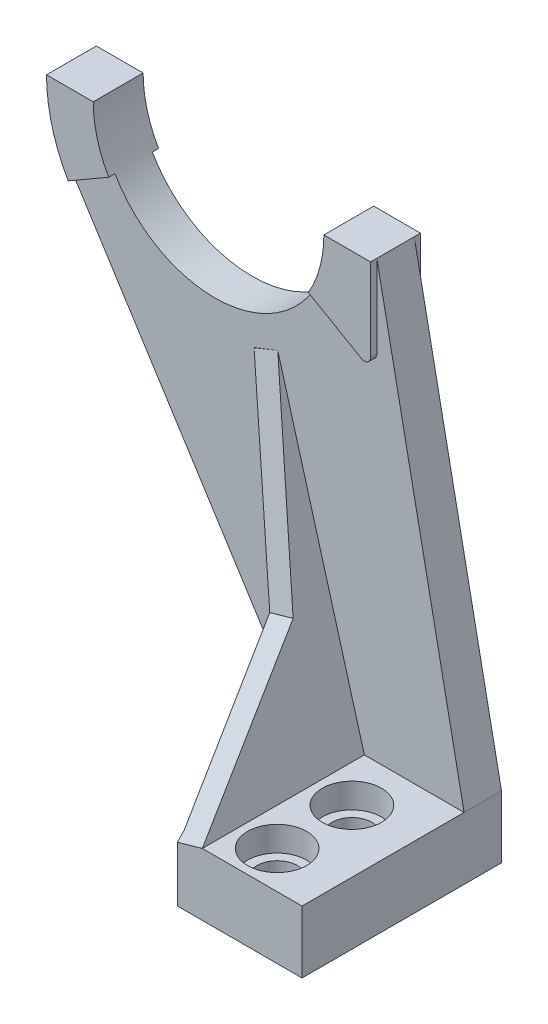
ISO-10303-21;
HEADER;
FILE_DESCRIPTION(('STEP AP214'),'2;1');
FILE_NAME('part.step','',(''),(''),'','','');
FILE_SCHEMA(('AUTOMOTIVE_DESIGN { 1 0 10303 214 1 1 1 1 }'));
ENDSEC;
DATA;
#1=APPLICATION_CONTEXT('core data for automotive mechanical design processes');
#2=APPLICATION_PROTOCOL_DEFINITION('international standard','automotive_design',2000,#1);
#3=PRODUCT_CONTEXT('',#1,'mechanical');
#4=PRODUCT('Part','Part','',(#3));
#5=PRODUCT_RELATED_PRODUCT_CATEGORY('part','',(#4));
#6=PRODUCT_DEFINITION_FORMATION('','',#4);
#7=PRODUCT_DEFINITION_CONTEXT('part definition',#1,'design');
#8=PRODUCT_DEFINITION('design','',#6,#7);
#9=PRODUCT_DEFINITION_SHAPE('','',#8);
#10=(LENGTH_UNIT() NAMED_UNIT(*) SI_UNIT(.MILLI.,.METRE.));
#11=(NAMED_UNIT(*) PLANE_ANGLE_UNIT() SI_UNIT($,.RADIAN.));
#12=(NAMED_UNIT(*) SI_UNIT($,.STERADIAN.) SOLID_ANGLE_UNIT());
#13=UNCERTAINTY_MEASURE_WITH_UNIT(LENGTH_MEASURE(1.E-05),#10,'distance_accuracy_value','');
#14=(GEOMETRIC_REPRESENTATION_CONTEXT(3) GLOBAL_UNCERTAINTY_ASSIGNED_CONTEXT((#13)) GLOBAL_UNIT_ASSIGNED_CONTEXT((#10,
#11,#12)) REPRESENTATION_CONTEXT('',''));
#15=CARTESIAN_POINT('',(0.,0.,0.));
#16=DIRECTION('',(0.,0.,1.));
#17=DIRECTION('',(1.,0.,0.));
#18=AXIS2_PLACEMENT_3D('',#15,#16,#17);
#19=CARTESIAN_POINT('',(0.,0.,9.525));
#20=DIRECTION('',(0.,0.,1.));
#21=DIRECTION('',(1.,0.,0.));
#22=AXIS2_PLACEMENT_3D('',#19,#20,#21);
#23=PLANE('',#22);
#24=DIRECTION('',(-0.931022526709216,-0.364961716841625,0.));
#25=VECTOR('',#24,1.);
#26=CARTESIAN_POINT('',(1.97344956518825,29.4120714378824,9.525));
#27=LINE('',#26,#25);
#28=CARTESIAN_POINT('',(4.92944608749001,30.5708248888546,9.525));
#29=VERTEX_POINT('',#28);
#30=CARTESIAN_POINT('',(-0.98254695711351,28.2533179869102,9.525));
#31=VERTEX_POINT('',#30);
#32=EDGE_CURVE('E224',#29,#31,#27,.T.);
#33=ORIENTED_EDGE('',*,*,#32,.F.);
#34=DIRECTION('',(-0.271492330217385,0.962440603171507,0.));
#35=VECTOR('',#34,1.);
#36=CARTESIAN_POINT('',(26.9875,-47.625,9.525));
#37=LINE('',#36,#35);
#38=CARTESIAN_POINT('',(26.9875,-47.625,9.525));
#39=VERTEX_POINT('',#38);
#40=EDGE_CURVE('E214',#39,#29,#37,.T.);
#41=ORIENTED_EDGE('',*,*,#40,.F.);
#42=DIRECTION('',(-1.,0.,0.));
#43=VECTOR('',#42,1.);
#44=CARTESIAN_POINT('',(20.6375,-47.625,9.525));
#45=LINE('',#44,#43);
#46=CARTESIAN_POINT('',(52.3875,-47.625,9.525));
#47=VERTEX_POINT('',#46);
#48=EDGE_CURVE('E327',#47,#39,#45,.T.);
#49=ORIENTED_EDGE('',*,*,#48,.F.);
#50=DIRECTION('',(0.196116135138184,-0.98058067569092,0.));
#51=VECTOR('',#50,1.);
#52=CARTESIAN_POINT('',(41.2139423076923,8.24278846153846,9.525));
#53=LINE('',#52,#51);
#54=CARTESIAN_POINT('',(30.1625,63.5,9.525));
#55=VERTEX_POINT('',#54);
#56=EDGE_CURVE('E350',#55,#47,#53,.T.);
#57=ORIENTED_EDGE('',*,*,#56,.F.);
#58=DIRECTION('',(0.,1.,0.));
#59=VECTOR('',#58,1.);
#60=CARTESIAN_POINT('',(30.1625,0.,9.525));
#61=LINE('',#60,#59);
#62=CARTESIAN_POINT('',(30.1625,42.4194982962137,9.525));
#63=VERTEX_POINT('',#62);
#64=EDGE_CURVE('E270',#63,#55,#61,.T.);
#65=ORIENTED_EDGE('',*,*,#64,.F.);
#66=CARTESIAN_POINT('',(28.575,42.4194982962137,9.525));
#67=DIRECTION('',(0.,0.,1.));
#68=DIRECTION('',(1.,0.,0.));
#69=AXIS2_PLACEMENT_3D('',#66,#67,#68);
#70=CIRCLE('',#69,1.5875);
#71=CARTESIAN_POINT('',(27.78125,41.0446829677059,9.525));
#72=VERTEX_POINT('',#71);
#73=EDGE_CURVE('E400',#63,#72,#70,.F.);
#74=ORIENTED_EDGE('',*,*,#73,.T.);
#75=DIRECTION('',(0.866025403784438,-0.500000000000001,0.));
#76=VECTOR('',#75,1.);
#77=CARTESIAN_POINT('',(24.7181815701559,42.8131463502226,9.525));
#78=LINE('',#77,#76);
#79=CARTESIAN_POINT('',(14.3215835773942,48.815625,9.525));
#80=VERTEX_POINT('',#79);
#81=EDGE_CURVE('E265',#80,#72,#78,.T.);
#82=ORIENTED_EDGE('',*,*,#81,.F.);
#83=CARTESIAN_POINT('',(-11.1125,63.5,9.525));
#84=DIRECTION('',(0.,0.,1.));
#85=DIRECTION('',(1.,0.,0.));
#86=AXIS2_PLACEMENT_3D('',#83,#84,#85);
#87=CIRCLE('',#86,29.36875);
#88=CARTESIAN_POINT('',(-36.5465835773942,48.815625,9.525));
#89=VERTEX_POINT('',#88);
#90=EDGE_CURVE('E354',#89,#80,#87,.T.);
#91=ORIENTED_EDGE('',*,*,#90,.F.);
#92=DIRECTION('',(-0.866025403784438,-0.500000000000001,0.));
#93=VECTOR('',#92,1.);
#94=CARTESIAN_POINT('',(-30.274431570156,52.4368536497772,9.525));
#95=LINE('',#94,#93);
#96=CARTESIAN_POINT('',(-46.8576985412027,42.8624999999999,9.525));
#97=VERTEX_POINT('',#96);
#98=EDGE_CURVE('E300',#89,#97,#95,.T.);
#99=ORIENTED_EDGE('',*,*,#98,.T.);
#100=DIRECTION('',(0.535801348283933,-0.844344073927874,0.));
#101=VECTOR('',#100,1.);
#102=CARTESIAN_POINT('',(-14.0146211828898,-8.89335657979918,9.525));
#103=LINE('',#102,#101);
#104=CARTESIAN_POINT('',(20.6375,-63.5,9.525));
#105=VERTEX_POINT('',#104);
#106=EDGE_CURVE('E348',#97,#105,#103,.T.);
#107=ORIENTED_EDGE('',*,*,#106,.T.);
#108=DIRECTION('',(0.,-1.,0.));
#109=VECTOR('',#108,1.);
#110=CARTESIAN_POINT('',(20.6375,-63.5,9.525));
#111=LINE('',#110,#109);
#112=CARTESIAN_POINT('',(20.6375,-47.625,9.525));
#113=VERTEX_POINT('',#112);
#114=EDGE_CURVE('E323',#113,#105,#111,.T.);
#115=ORIENTED_EDGE('',*,*,#114,.F.);
#116=DIRECTION('',(0.274024159068524,-0.961722808425998,0.));
#117=VECTOR('',#116,1.);
#118=CARTESIAN_POINT('',(-0.98254695711351,28.2533179869102,9.525));
#119=LINE('',#118,#117);
#120=EDGE_CURVE('E227',#31,#113,#119,.T.);
#121=ORIENTED_EDGE('',*,*,#120,.F.);
#122=EDGE_LOOP('',(#33,#41,#49,#57,#65,#74,#82,#91,#99,#107,#115,#121));
#123=FACE_BOUND('',#122,.T.);
#124=ADVANCED_FACE('F35',(#123),#23,.T.);
#125=CARTESIAN_POINT('',(20.6375,-47.625,50.8));
#126=DIRECTION('',(0.,-1.,0.));
#127=DIRECTION('',(0.,0.,-1.));
#128=AXIS2_PLACEMENT_3D('',#125,#126,#127);
#129=PLANE('',#128);
#130=CARTESIAN_POINT('',(36.5125,-47.625,22.225));
#131=DIRECTION('',(0.,1.,0.));
#132=DIRECTION('',(0.,0.,1.));
#133=AXIS2_PLACEMENT_3D('',#130,#131,#132);
#134=CIRCLE('',#133,7.540625);
#135=CARTESIAN_POINT('',(36.5125,-47.625,29.765625));
#136=VERTEX_POINT('',#135);
#137=EDGE_CURVE('E314',#136,#136,#134,.T.);
#138=ORIENTED_EDGE('',*,*,#137,.F.);
#139=EDGE_LOOP('',(#138));
#140=FACE_BOUND('',#139,.T.);
#141=CARTESIAN_POINT('',(36.5125,-47.625,41.275));
#142=DIRECTION('',(0.,1.,0.));
#143=DIRECTION('',(0.,0.,1.));
#144=AXIS2_PLACEMENT_3D('',#141,#142,#143);
#145=CIRCLE('',#144,7.540625);
#146=CARTESIAN_POINT('',(36.5125,-47.625,48.815625));
#147=VERTEX_POINT('',#146);
#148=EDGE_CURVE('E303',#147,#147,#145,.T.);
#149=ORIENTED_EDGE('',*,*,#148,.F.);
#150=EDGE_LOOP('',(#149));
#151=FACE_BOUND('',#150,.T.);
#152=DIRECTION('',(0.,0.,-1.));
#153=VECTOR('',#152,1.);
#154=CARTESIAN_POINT('',(26.9875,-47.625,50.8));
#155=LINE('',#154,#153);
#156=CARTESIAN_POINT('',(26.9875,-47.625,50.8));
#157=VERTEX_POINT('',#156);
#158=EDGE_CURVE('E232',#157,#39,#155,.T.);
#159=ORIENTED_EDGE('',*,*,#158,.F.);
#160=DIRECTION('',(-1.,0.,0.));
#161=VECTOR('',#160,1.);
#162=CARTESIAN_POINT('',(20.6375,-47.625,50.8));
#163=LINE('',#162,#161);
#164=CARTESIAN_POINT('',(52.3875,-47.625,50.8));
#165=VERTEX_POINT('',#164);
#166=EDGE_CURVE('E332',#165,#157,#163,.T.);
#167=ORIENTED_EDGE('',*,*,#166,.F.);
#168=DIRECTION('',(0.,0.,-1.));
#169=VECTOR('',#168,1.);
#170=CARTESIAN_POINT('',(52.3875,-47.625,50.8));
#171=LINE('',#170,#169);
#172=EDGE_CURVE('E341',#165,#47,#171,.T.);
#173=ORIENTED_EDGE('',*,*,#172,.T.);
#174=ORIENTED_EDGE('',*,*,#48,.T.);
#175=EDGE_LOOP('',(#159,#167,#173,#174));
#176=FACE_BOUND('',#175,.T.);
#177=ADVANCED_FACE('F429',(#140,#151,#176),#129,.F.);
#178=CARTESIAN_POINT('',(0.,0.,0.));
#179=DIRECTION('',(0.,0.,1.));
#180=DIRECTION('',(1.,0.,0.));
#181=AXIS2_PLACEMENT_3D('',#178,#179,#180);
#182=PLANE('',#181);
#183=CARTESIAN_POINT('',(-11.1125,63.5,0.));
#184=DIRECTION('',(0.,0.,1.));
#185=DIRECTION('',(1.,0.,0.));
#186=AXIS2_PLACEMENT_3D('',#183,#184,#185);
#187=CIRCLE('',#186,29.36875);
#188=CARTESIAN_POINT('',(-36.5465835773942,48.815625,0.));
#189=VERTEX_POINT('',#188);
#190=CARTESIAN_POINT('',(14.3215835773942,48.815625,0.));
#191=VERTEX_POINT('',#190);
#192=EDGE_CURVE('E351',#189,#191,#187,.T.);
#193=ORIENTED_EDGE('',*,*,#192,.T.);
#194=DIRECTION('',(0.866025403784438,-0.500000000000001,0.));
#195=VECTOR('',#194,1.);
#196=CARTESIAN_POINT('',(24.7181815701559,42.8131463502226,0.));
#197=LINE('',#196,#195);
#198=CARTESIAN_POINT('',(27.78125,41.0446829677059,0.));
#199=VERTEX_POINT('',#198);
#200=EDGE_CURVE('E263',#191,#199,#197,.T.);
#201=ORIENTED_EDGE('',*,*,#200,.T.);
#202=CARTESIAN_POINT('',(28.575,42.4194982962137,0.));
#203=DIRECTION('',(0.,0.,1.));
#204=DIRECTION('',(1.,0.,0.));
#205=AXIS2_PLACEMENT_3D('',#202,#203,#204);
#206=CIRCLE('',#205,1.5875);
#207=CARTESIAN_POINT('',(30.1625,42.4194982962137,0.));
#208=VERTEX_POINT('',#207);
#209=EDGE_CURVE('E408',#199,#208,#206,.T.);
#210=ORIENTED_EDGE('',*,*,#209,.T.);
#211=DIRECTION('',(0.,1.,0.));
#212=VECTOR('',#211,1.);
#213=CARTESIAN_POINT('',(30.1625,0.,0.));
#214=LINE('',#213,#212);
#215=CARTESIAN_POINT('',(30.1625,63.5,0.));
#216=VERTEX_POINT('',#215);
#217=EDGE_CURVE('E268',#208,#216,#214,.T.);
#218=ORIENTED_EDGE('',*,*,#217,.T.);
#219=DIRECTION('',(0.196116135138184,-0.98058067569092,0.));
#220=VECTOR('',#219,1.);
#221=CARTESIAN_POINT('',(41.2139423076923,8.24278846153846,0.));
#222=LINE('',#221,#220);
#223=CARTESIAN_POINT('',(52.3875,-47.625,0.));
#224=VERTEX_POINT('',#223);
#225=EDGE_CURVE('E366',#216,#224,#222,.T.);
#226=ORIENTED_EDGE('',*,*,#225,.T.);
#227=DIRECTION('',(0.,-1.,0.));
#228=VECTOR('',#227,1.);
#229=CARTESIAN_POINT('',(52.3875,0.,0.));
#230=LINE('',#229,#228);
#231=CARTESIAN_POINT('',(52.3875,-63.5,0.));
#232=VERTEX_POINT('',#231);
#233=EDGE_CURVE('E363',#224,#232,#230,.T.);
#234=ORIENTED_EDGE('',*,*,#233,.T.);
#235=DIRECTION('',(-1.,0.,0.));
#236=VECTOR('',#235,1.);
#237=CARTESIAN_POINT('',(0.,-63.5,0.));
#238=LINE('',#237,#236);
#239=CARTESIAN_POINT('',(20.6375,-63.5,0.));
#240=VERTEX_POINT('',#239);
#241=EDGE_CURVE('E360',#232,#240,#238,.T.);
#242=ORIENTED_EDGE('',*,*,#241,.T.);
#243=DIRECTION('',(0.535801348283933,-0.844344073927874,0.));
#244=VECTOR('',#243,1.);
#245=CARTESIAN_POINT('',(-14.0146211828898,-8.89335657979918,0.));
#246=LINE('',#245,#244);
#247=CARTESIAN_POINT('',(-46.8576985412027,42.8624999999999,0.));
#248=VERTEX_POINT('',#247);
#249=EDGE_CURVE('E347',#248,#240,#246,.T.);
#250=ORIENTED_EDGE('',*,*,#249,.F.);
#251=DIRECTION('',(-0.866025403784438,-0.500000000000001,0.));
#252=VECTOR('',#251,1.);
#253=CARTESIAN_POINT('',(-30.274431570156,52.4368536497772,0.));
#254=LINE('',#253,#252);
#255=EDGE_CURVE('E386',#189,#248,#254,.T.);
#256=ORIENTED_EDGE('',*,*,#255,.F.);
#257=EDGE_LOOP('',(#193,#201,#210,#218,#226,#234,#242,#250,#256));
#258=FACE_BOUND('',#257,.T.);
#259=ADVANCED_FACE('F486',(#258),#182,.F.);
#260=CARTESIAN_POINT('',(36.5125,-63.5,41.275));
#261=DIRECTION('',(0.,1.,0.));
#262=DIRECTION('',(0.,0.,1.));
#263=AXIS2_PLACEMENT_3D('',#260,#261,#262);
#264=CYLINDRICAL_SURFACE('',#263,5.159375);
#265=CARTESIAN_POINT('',(36.5125,-63.5,41.275));
#266=DIRECTION('',(0.,1.,0.));
#267=DIRECTION('',(0.,0.,1.));
#268=AXIS2_PLACEMENT_3D('',#265,#266,#267);
#269=CIRCLE('',#268,5.159375);
#270=CARTESIAN_POINT('',(36.5125,-63.5,46.434375));
#271=VERTEX_POINT('',#270);
#272=EDGE_CURVE('E320',#271,#271,#269,.T.);
#273=ORIENTED_EDGE('',*,*,#272,.F.);
#274=EDGE_LOOP('',(#273));
#275=FACE_BOUND('',#274,.T.);
#276=CARTESIAN_POINT('',(36.5125,-53.975,41.275));
#277=DIRECTION('',(0.,1.,0.));
#278=DIRECTION('',(0.,0.,1.));
#279=AXIS2_PLACEMENT_3D('',#276,#277,#278);
#280=CIRCLE('',#279,5.159375);
#281=CARTESIAN_POINT('',(36.5125,-53.975,46.434375));
#282=VERTEX_POINT('',#281);
#283=EDGE_CURVE('E307',#282,#282,#280,.F.);
#284=ORIENTED_EDGE('',*,*,#283,.F.);
#285=EDGE_LOOP('',(#284));
#286=FACE_BOUND('',#285,.T.);
#287=ADVANCED_FACE('F493',(#275,#286),#264,.F.);
#288=CARTESIAN_POINT('',(36.5125,-63.5,22.225));
#289=DIRECTION('',(0.,1.,0.));
#290=DIRECTION('',(0.,0.,1.));
#291=AXIS2_PLACEMENT_3D('',#288,#289,#290);
#292=CYLINDRICAL_SURFACE('',#291,5.159375);
#293=CARTESIAN_POINT('',(36.5125,-63.5,22.225));
#294=DIRECTION('',(0.,1.,0.));
#295=DIRECTION('',(0.,0.,1.));
#296=AXIS2_PLACEMENT_3D('',#293,#294,#295);
#297=CIRCLE('',#296,5.159375);
#298=CARTESIAN_POINT('',(36.5125,-63.5,27.384375));
#299=VERTEX_POINT('',#298);
#300=EDGE_CURVE('E317',#299,#299,#297,.T.);
#301=ORIENTED_EDGE('',*,*,#300,.F.);
#302=EDGE_LOOP('',(#301));
#303=FACE_BOUND('',#302,.T.);
#304=CARTESIAN_POINT('',(36.5125,-53.975,22.225));
#305=DIRECTION('',(0.,1.,0.));
#306=DIRECTION('',(0.,0.,1.));
#307=AXIS2_PLACEMENT_3D('',#304,#305,#306);
#308=CIRCLE('',#307,5.159375);
#309=CARTESIAN_POINT('',(36.5125,-53.975,27.384375));
#310=VERTEX_POINT('',#309);
#311=EDGE_CURVE('E313',#310,#310,#308,.F.);
#312=ORIENTED_EDGE('',*,*,#311,.F.);
#313=EDGE_LOOP('',(#312));
#314=FACE_BOUND('',#313,.T.);
#315=ADVANCED_FACE('F517',(#303,#314),#292,.F.);
#316=CARTESIAN_POINT('',(0.,63.5,9.525));
#317=DIRECTION('',(0.,1.,0.));
#318=DIRECTION('',(0.,0.,1.));
#319=AXIS2_PLACEMENT_3D('',#316,#317,#318);
#320=PLANE('',#319);
#321=DIRECTION('',(0.,0.,-1.));
#322=VECTOR('',#321,1.);
#323=CARTESIAN_POINT('',(-40.48125,63.5,9.525));
#324=LINE('',#323,#322);
#325=CARTESIAN_POINT('',(-40.48125,63.5,11.1125));
#326=VERTEX_POINT('',#325);
#327=CARTESIAN_POINT('',(-40.48125,63.5,-1.5875));
#328=VERTEX_POINT('',#327);
#329=EDGE_CURVE('E357',#326,#328,#324,.T.);
#330=ORIENTED_EDGE('',*,*,#329,.T.);
#331=DIRECTION('',(1.,0.,0.));
#332=VECTOR('',#331,1.);
#333=CARTESIAN_POINT('',(0.,63.5,-1.5875));
#334=LINE('',#333,#332);
#335=CARTESIAN_POINT('',(-52.3875,63.5,-1.5875));
#336=VERTEX_POINT('',#335);
#337=EDGE_CURVE('E272',#336,#328,#334,.T.);
#338=ORIENTED_EDGE('',*,*,#337,.F.);
#339=DIRECTION('',(0.,0.,-1.));
#340=VECTOR('',#339,1.);
#341=CARTESIAN_POINT('',(-52.3875,63.5,9.525));
#342=LINE('',#341,#340);
#343=CARTESIAN_POINT('',(-52.3875,63.5,11.1125));
#344=VERTEX_POINT('',#343);
#345=EDGE_CURVE('E384',#344,#336,#342,.T.);
#346=ORIENTED_EDGE('',*,*,#345,.F.);
#347=DIRECTION('',(1.,0.,0.));
#348=VECTOR('',#347,1.);
#349=CARTESIAN_POINT('',(0.,63.5,11.1125));
#350=LINE('',#349,#348);
#351=EDGE_CURVE('E273',#344,#326,#350,.T.);
#352=ORIENTED_EDGE('',*,*,#351,.T.);
#353=EDGE_LOOP('',(#330,#338,#346,#352));
#354=FACE_BOUND('',#353,.T.);
#355=ADVANCED_FACE('F514',(#354),#320,.T.);
#356=CARTESIAN_POINT('',(-11.1125,63.5,9.525));
#357=DIRECTION('',(0.,0.,-1.));
#358=DIRECTION('',(-1.,0.,0.));
#359=AXIS2_PLACEMENT_3D('',#356,#357,#358);
#360=CYLINDRICAL_SURFACE('',#359,41.275);
#361=ORIENTED_EDGE('',*,*,#345,.T.);
#362=CARTESIAN_POINT('',(-11.1125,63.5,-1.5875));
#363=DIRECTION('',(0.,0.,1.));
#364=DIRECTION('',(1.,0.,0.));
#365=AXIS2_PLACEMENT_3D('',#362,#363,#364);
#366=CIRCLE('',#365,41.275);
#367=CARTESIAN_POINT('',(-46.8576985412027,42.8624999999999,-1.5875));
#368=VERTEX_POINT('',#367);
#369=EDGE_CURVE('E287',#336,#368,#366,.T.);
#370=ORIENTED_EDGE('',*,*,#369,.T.);
#371=DIRECTION('',(0.,0.,-1.));
#372=VECTOR('',#371,1.);
#373=CARTESIAN_POINT('',(-46.8576985412027,42.8624999999999,11.1125));
#374=LINE('',#373,#372);
#375=EDGE_CURVE('E297',#248,#368,#374,.T.);
#376=ORIENTED_EDGE('',*,*,#375,.F.);
#377=DIRECTION('',(0.,0.,-1.));
#378=VECTOR('',#377,1.);
#379=CARTESIAN_POINT('',(-46.8576985412027,42.8624999999999,9.525));
#380=LINE('',#379,#378);
#381=EDGE_CURVE('E382',#97,#248,#380,.T.);
#382=ORIENTED_EDGE('',*,*,#381,.F.);
#383=CARTESIAN_POINT('',(-46.8576985412027,42.8624999999999,11.1125));
#384=VERTEX_POINT('',#383);
#385=EDGE_CURVE('E298',#384,#97,#374,.T.);
#386=ORIENTED_EDGE('',*,*,#385,.F.);
#387=CARTESIAN_POINT('',(-11.1125,63.5,11.1125));
#388=DIRECTION('',(0.,0.,1.));
#389=DIRECTION('',(1.,0.,0.));
#390=AXIS2_PLACEMENT_3D('',#387,#388,#389);
#391=CIRCLE('',#390,41.275);
#392=EDGE_CURVE('E276',#344,#384,#391,.T.);
#393=ORIENTED_EDGE('',*,*,#392,.F.);
#394=EDGE_LOOP('',(#361,#370,#376,#382,#386,#393));
#395=FACE_BOUND('',#394,.T.);
#396=ADVANCED_FACE('F510',(#395),#360,.T.);
#397=CARTESIAN_POINT('',(-14.0146211828898,-8.89335657979918,9.525));
#398=DIRECTION('',(0.844344073927874,0.535801348283933,0.));
#399=DIRECTION('',(-0.535801348283933,0.844344073927874,0.));
#400=AXIS2_PLACEMENT_3D('',#397,#398,#399);
#401=PLANE('',#400);
#402=ORIENTED_EDGE('',*,*,#249,.T.);
#403=DIRECTION('',(0.,0.,-1.));
#404=VECTOR('',#403,1.);
#405=CARTESIAN_POINT('',(20.6375,-63.5,9.525));
#406=LINE('',#405,#404);
#407=EDGE_CURVE('E380',#105,#240,#406,.T.);
#408=ORIENTED_EDGE('',*,*,#407,.F.);
#409=ORIENTED_EDGE('',*,*,#106,.F.);
#410=ORIENTED_EDGE('',*,*,#381,.T.);
#411=EDGE_LOOP('',(#402,#408,#409,#410));
#412=FACE_BOUND('',#411,.T.);
#413=ADVANCED_FACE('F506',(#412),#401,.F.);
#414=CARTESIAN_POINT('',(0.,-63.5,9.525));
#415=DIRECTION('',(0.,-1.,0.));
#416=DIRECTION('',(0.,0.,-1.));
#417=AXIS2_PLACEMENT_3D('',#414,#415,#416);
#418=PLANE('',#417);
#419=ORIENTED_EDGE('',*,*,#300,.T.);
#420=EDGE_LOOP('',(#419));
#421=FACE_BOUND('',#420,.T.);
#422=ORIENTED_EDGE('',*,*,#272,.T.);
#423=EDGE_LOOP('',(#422));
#424=FACE_BOUND('',#423,.T.);
#425=ORIENTED_EDGE('',*,*,#241,.F.);
#426=DIRECTION('',(0.,0.,-1.));
#427=VECTOR('',#426,1.);
#428=CARTESIAN_POINT('',(52.3875,-63.5,9.525));
#429=LINE('',#428,#427);
#430=CARTESIAN_POINT('',(52.3875,-63.5,50.8));
#431=VERTEX_POINT('',#430);
#432=EDGE_CURVE('E378',#431,#232,#429,.T.);
#433=ORIENTED_EDGE('',*,*,#432,.F.);
#434=DIRECTION('',(1.,0.,0.));
#435=VECTOR('',#434,1.);
#436=CARTESIAN_POINT('',(20.6375,-63.5,50.8));
#437=LINE('',#436,#435);
#438=CARTESIAN_POINT('',(20.6375,-63.5,50.8));
#439=VERTEX_POINT('',#438);
#440=EDGE_CURVE('E326',#439,#431,#437,.T.);
#441=ORIENTED_EDGE('',*,*,#440,.F.);
#442=DIRECTION('',(0.,0.,-1.));
#443=VECTOR('',#442,1.);
#444=CARTESIAN_POINT('',(20.6375,-63.5,50.8));
#445=LINE('',#444,#443);
#446=EDGE_CURVE('E344',#439,#105,#445,.T.);
#447=ORIENTED_EDGE('',*,*,#446,.T.);
#448=ORIENTED_EDGE('',*,*,#407,.T.);
#449=EDGE_LOOP('',(#425,#433,#441,#447,#448));
#450=FACE_BOUND('',#449,.T.);
#451=ADVANCED_FACE('F503',(#421,#424,#450),#418,.T.);
#452=CARTESIAN_POINT('',(52.3875,0.,9.525));
#453=DIRECTION('',(1.,0.,0.));
#454=DIRECTION('',(0.,0.,-1.));
#455=AXIS2_PLACEMENT_3D('',#452,#453,#454);
#456=PLANE('',#455);
#457=ORIENTED_EDGE('',*,*,#233,.F.);
#458=DIRECTION('',(0.,0.,-1.));
#459=VECTOR('',#458,1.);
#460=CARTESIAN_POINT('',(52.3875,-47.625,9.525));
#461=LINE('',#460,#459);
#462=EDGE_CURVE('E376',#47,#224,#461,.T.);
#463=ORIENTED_EDGE('',*,*,#462,.F.);
#464=ORIENTED_EDGE('',*,*,#172,.F.);
#465=DIRECTION('',(0.,1.,0.));
#466=VECTOR('',#465,1.);
#467=CARTESIAN_POINT('',(52.3875,-63.5,50.8));
#468=LINE('',#467,#466);
#469=EDGE_CURVE('E330',#431,#165,#468,.T.);
#470=ORIENTED_EDGE('',*,*,#469,.F.);
#471=ORIENTED_EDGE('',*,*,#432,.T.);
#472=EDGE_LOOP('',(#457,#463,#464,#470,#471));
#473=FACE_BOUND('',#472,.T.);
#474=ADVANCED_FACE('F435',(#473),#456,.T.);
#475=CARTESIAN_POINT('',(41.2139423076923,8.24278846153846,9.525));
#476=DIRECTION('',(0.98058067569092,0.196116135138184,0.));
#477=DIRECTION('',(-0.196116135138184,0.98058067569092,0.));
#478=AXIS2_PLACEMENT_3D('',#475,#476,#477);
#479=PLANE('',#478);
#480=ORIENTED_EDGE('',*,*,#225,.F.);
#481=DIRECTION('',(0.,0.,-1.));
#482=VECTOR('',#481,1.);
#483=CARTESIAN_POINT('',(30.1625,63.5,9.525));
#484=LINE('',#483,#482);
#485=EDGE_CURVE('E373',#55,#216,#484,.T.);
#486=ORIENTED_EDGE('',*,*,#485,.F.);
#487=ORIENTED_EDGE('',*,*,#56,.T.);
#488=ORIENTED_EDGE('',*,*,#462,.T.);
#489=EDGE_LOOP('',(#480,#486,#487,#488));
#490=FACE_BOUND('',#489,.T.);
#491=ADVANCED_FACE('F439',(#490),#479,.T.);
#492=CARTESIAN_POINT('',(0.,63.5,9.525));
#493=DIRECTION('',(0.,1.,0.));
#494=DIRECTION('',(0.,0.,1.));
#495=AXIS2_PLACEMENT_3D('',#492,#493,#494);
#496=PLANE('',#495);
#497=ORIENTED_EDGE('',*,*,#485,.T.);
#498=DIRECTION('',(0.,0.,-1.));
#499=VECTOR('',#498,1.);
#500=CARTESIAN_POINT('',(30.1625,63.5,11.1125));
#501=LINE('',#500,#499);
#502=CARTESIAN_POINT('',(30.1625,63.5,-1.5875));
#503=VERTEX_POINT('',#502);
#504=EDGE_CURVE('E247',#216,#503,#501,.T.);
#505=ORIENTED_EDGE('',*,*,#504,.T.);
#506=DIRECTION('',(1.,0.,0.));
#507=VECTOR('',#506,1.);
#508=CARTESIAN_POINT('',(0.,63.5,-1.5875));
#509=LINE('',#508,#507);
#510=CARTESIAN_POINT('',(18.25625,63.5,-1.5875));
#511=VERTEX_POINT('',#510);
#512=EDGE_CURVE('E239',#511,#503,#509,.T.);
#513=ORIENTED_EDGE('',*,*,#512,.F.);
#514=DIRECTION('',(0.,0.,-1.));
#515=VECTOR('',#514,1.);
#516=CARTESIAN_POINT('',(18.25625,63.5,9.525));
#517=LINE('',#516,#515);
#518=CARTESIAN_POINT('',(18.25625,63.5,11.1125));
#519=VERTEX_POINT('',#518);
#520=EDGE_CURVE('E371',#519,#511,#517,.T.);
#521=ORIENTED_EDGE('',*,*,#520,.F.);
#522=DIRECTION('',(1.,0.,0.));
#523=VECTOR('',#522,1.);
#524=CARTESIAN_POINT('',(0.,63.5,11.1125));
#525=LINE('',#524,#523);
#526=CARTESIAN_POINT('',(30.1625,63.5,11.1125));
#527=VERTEX_POINT('',#526);
#528=EDGE_CURVE('E244',#519,#527,#525,.T.);
#529=ORIENTED_EDGE('',*,*,#528,.T.);
#530=EDGE_CURVE('E257',#527,#55,#501,.T.);
#531=ORIENTED_EDGE('',*,*,#530,.T.);
#532=EDGE_LOOP('',(#497,#505,#513,#521,#529,#531));
#533=FACE_BOUND('',#532,.T.);
#534=ADVANCED_FACE('F442',(#533),#496,.T.);
#535=CARTESIAN_POINT('',(-11.1125,63.5,9.525));
#536=DIRECTION('',(0.,0.,-1.));
#537=DIRECTION('',(-1.,0.,0.));
#538=AXIS2_PLACEMENT_3D('',#535,#536,#537);
#539=CYLINDRICAL_SURFACE('',#538,29.36875);
#540=ORIENTED_EDGE('',*,*,#90,.T.);
#541=DIRECTION('',(0.,0.,-1.));
#542=VECTOR('',#541,1.);
#543=CARTESIAN_POINT('',(14.3215835773942,48.815625,11.1125));
#544=LINE('',#543,#542);
#545=CARTESIAN_POINT('',(14.3215835773942,48.815625,11.1125));
#546=VERTEX_POINT('',#545);
#547=EDGE_CURVE('E261',#546,#80,#544,.T.);
#548=ORIENTED_EDGE('',*,*,#547,.F.);
#549=CARTESIAN_POINT('',(-11.1125,63.5,11.1125));
#550=DIRECTION('',(0.,0.,1.));
#551=DIRECTION('',(1.,0.,0.));
#552=AXIS2_PLACEMENT_3D('',#549,#550,#551);
#553=CIRCLE('',#552,29.36875);
#554=EDGE_CURVE('E235',#546,#519,#553,.T.);
#555=ORIENTED_EDGE('',*,*,#554,.T.);
#556=ORIENTED_EDGE('',*,*,#520,.T.);
#557=CARTESIAN_POINT('',(-11.1125,63.5,-1.5875));
#558=DIRECTION('',(0.,0.,1.));
#559=DIRECTION('',(1.,0.,0.));
#560=AXIS2_PLACEMENT_3D('',#557,#558,#559);
#561=CIRCLE('',#560,29.36875);
#562=CARTESIAN_POINT('',(14.3215835773942,48.815625,-1.5875));
#563=VERTEX_POINT('',#562);
#564=EDGE_CURVE('E234',#563,#511,#561,.T.);
#565=ORIENTED_EDGE('',*,*,#564,.F.);
#566=EDGE_CURVE('E260',#191,#563,#544,.T.);
#567=ORIENTED_EDGE('',*,*,#566,.F.);
#568=ORIENTED_EDGE('',*,*,#192,.F.);
#569=DIRECTION('',(0.,0.,-1.));
#570=VECTOR('',#569,1.);
#571=CARTESIAN_POINT('',(-36.5465835773942,48.815625,11.1125));
#572=LINE('',#571,#570);
#573=CARTESIAN_POINT('',(-36.5465835773942,48.815625,-1.5875));
#574=VERTEX_POINT('',#573);
#575=EDGE_CURVE('E284',#189,#574,#572,.T.);
#576=ORIENTED_EDGE('',*,*,#575,.T.);
#577=CARTESIAN_POINT('',(-11.1125,63.5,-1.5875));
#578=DIRECTION('',(0.,0.,1.));
#579=DIRECTION('',(1.,0.,0.));
#580=AXIS2_PLACEMENT_3D('',#577,#578,#579);
#581=CIRCLE('',#580,29.36875);
#582=EDGE_CURVE('E277',#328,#574,#581,.T.);
#583=ORIENTED_EDGE('',*,*,#582,.F.);
#584=ORIENTED_EDGE('',*,*,#329,.F.);
#585=CARTESIAN_POINT('',(-11.1125,63.5,11.1125));
#586=DIRECTION('',(0.,0.,1.));
#587=DIRECTION('',(1.,0.,0.));
#588=AXIS2_PLACEMENT_3D('',#585,#586,#587);
#589=CIRCLE('',#588,29.36875);
#590=CARTESIAN_POINT('',(-36.5465835773942,48.815625,11.1125));
#591=VERTEX_POINT('',#590);
#592=EDGE_CURVE('E281',#326,#591,#589,.T.);
#593=ORIENTED_EDGE('',*,*,#592,.T.);
#594=EDGE_CURVE('E295',#591,#89,#572,.T.);
#595=ORIENTED_EDGE('',*,*,#594,.T.);
#596=EDGE_LOOP('',(#540,#548,#555,#556,#565,#567,#568,#576,#583,#584,#593,#595));
#597=FACE_BOUND('',#596,.T.);
#598=ADVANCED_FACE('F456',(#597),#539,.F.);
#599=CARTESIAN_POINT('',(20.6375,-63.5,50.8));
#600=DIRECTION('',(1.,0.,0.));
#601=DIRECTION('',(0.,0.,-1.));
#602=AXIS2_PLACEMENT_3D('',#599,#600,#601);
#603=PLANE('',#602);
#604=DIRECTION('',(0.,-1.,0.));
#605=VECTOR('',#604,1.);
#606=CARTESIAN_POINT('',(20.6375,-63.5,50.8));
#607=LINE('',#606,#605);
#608=CARTESIAN_POINT('',(20.6375,-49.4162547446559,50.8));
#609=VERTEX_POINT('',#608);
#610=EDGE_CURVE('E324',#609,#439,#607,.T.);
#611=ORIENTED_EDGE('',*,*,#610,.F.);
#612=DIRECTION('',(0.,0.72050823534908,-0.693446380619407));
#613=VECTOR('',#612,1.);
#614=CARTESIAN_POINT('',(20.6375,-56.7275792372504,57.8367155546353));
#615=LINE('',#614,#613);
#616=CARTESIAN_POINT('',(20.6375,-47.625,49.0760237031196));
#617=VERTEX_POINT('',#616);
#618=EDGE_CURVE('E220',#609,#617,#615,.T.);
#619=ORIENTED_EDGE('',*,*,#618,.T.);
#620=DIRECTION('',(0.,0.,-1.));
#621=VECTOR('',#620,1.);
#622=CARTESIAN_POINT('',(20.6375,-47.625,50.8));
#623=LINE('',#622,#621);
#624=EDGE_CURVE('E335',#617,#113,#623,.T.);
#625=ORIENTED_EDGE('',*,*,#624,.T.);
#626=ORIENTED_EDGE('',*,*,#114,.T.);
#627=ORIENTED_EDGE('',*,*,#446,.F.);
#628=EDGE_LOOP('',(#611,#619,#625,#626,#627));
#629=FACE_BOUND('',#628,.T.);
#630=ADVANCED_FACE('F420',(#629),#603,.F.);
#631=CARTESIAN_POINT('',(0.,0.,50.8));
#632=DIRECTION('',(0.,0.,-1.));
#633=DIRECTION('',(-1.,0.,0.));
#634=AXIS2_PLACEMENT_3D('',#631,#632,#633);
#635=PLANE('',#634);
#636=ORIENTED_EDGE('',*,*,#166,.T.);
#637=DIRECTION('',(0.962440603171507,0.271492330217385,0.));
#638=VECTOR('',#637,1.);
#639=CARTESIAN_POINT('',(-12.737235895904,-58.8308459297226,50.8));
#640=LINE('',#639,#638);
#641=EDGE_CURVE('E202',#609,#157,#640,.T.);
#642=ORIENTED_EDGE('',*,*,#641,.F.);
#643=ORIENTED_EDGE('',*,*,#610,.T.);
#644=ORIENTED_EDGE('',*,*,#440,.T.);
#645=ORIENTED_EDGE('',*,*,#469,.T.);
#646=EDGE_LOOP('',(#636,#642,#643,#644,#645));
#647=FACE_BOUND('',#646,.T.);
#648=ADVANCED_FACE('F423',(#647),#635,.F.);
#649=CARTESIAN_POINT('',(36.5125,-53.975,22.225));
#650=DIRECTION('',(0.,1.,0.));
#651=DIRECTION('',(0.,0.,1.));
#652=AXIS2_PLACEMENT_3D('',#649,#650,#651);
#653=PLANE('',#652);
#654=CARTESIAN_POINT('',(36.5125,-53.975,22.225));
#655=DIRECTION('',(0.,1.,0.));
#656=DIRECTION('',(0.,0.,1.));
#657=AXIS2_PLACEMENT_3D('',#654,#655,#656);
#658=CIRCLE('',#657,7.540625);
#659=CARTESIAN_POINT('',(36.5125,-53.975,29.765625));
#660=VERTEX_POINT('',#659);
#661=EDGE_CURVE('E310',#660,#660,#658,.T.);
#662=ORIENTED_EDGE('',*,*,#661,.T.);
#663=EDGE_LOOP('',(#662));
#664=FACE_BOUND('',#663,.T.);
#665=ORIENTED_EDGE('',*,*,#311,.T.);
#666=EDGE_LOOP('',(#665));
#667=FACE_BOUND('',#666,.T.);
#668=ADVANCED_FACE('F560',(#664,#667),#653,.T.);
#669=CARTESIAN_POINT('',(36.5125,-53.975,22.225));
#670=DIRECTION('',(0.,1.,0.));
#671=DIRECTION('',(0.,0.,1.));
#672=AXIS2_PLACEMENT_3D('',#669,#670,#671);
#673=CYLINDRICAL_SURFACE('',#672,7.540625);
#674=ORIENTED_EDGE('',*,*,#661,.F.);
#675=EDGE_LOOP('',(#674));
#676=FACE_BOUND('',#675,.T.);
#677=ORIENTED_EDGE('',*,*,#137,.T.);
#678=EDGE_LOOP('',(#677));
#679=FACE_BOUND('',#678,.T.);
#680=ADVANCED_FACE('F555',(#676,#679),#673,.F.);
#681=CARTESIAN_POINT('',(36.5125,-53.975,41.275));
#682=DIRECTION('',(0.,1.,0.));
#683=DIRECTION('',(0.,0.,1.));
#684=AXIS2_PLACEMENT_3D('',#681,#682,#683);
#685=PLANE('',#684);
#686=CARTESIAN_POINT('',(36.5125,-53.975,41.275));
#687=DIRECTION('',(0.,1.,0.));
#688=DIRECTION('',(0.,0.,1.));
#689=AXIS2_PLACEMENT_3D('',#686,#687,#688);
#690=CIRCLE('',#689,7.540625);
#691=CARTESIAN_POINT('',(36.5125,-53.975,48.815625));
#692=VERTEX_POINT('',#691);
#693=EDGE_CURVE('E304',#692,#692,#690,.T.);
#694=ORIENTED_EDGE('',*,*,#693,.T.);
#695=EDGE_LOOP('',(#694));
#696=FACE_BOUND('',#695,.T.);
#697=ORIENTED_EDGE('',*,*,#283,.T.);
#698=EDGE_LOOP('',(#697));
#699=FACE_BOUND('',#698,.T.);
#700=ADVANCED_FACE('F552',(#696,#699),#685,.T.);
#701=CARTESIAN_POINT('',(36.5125,-53.975,41.275));
#702=DIRECTION('',(0.,1.,0.));
#703=DIRECTION('',(0.,0.,1.));
#704=AXIS2_PLACEMENT_3D('',#701,#702,#703);
#705=CYLINDRICAL_SURFACE('',#704,7.540625);
#706=ORIENTED_EDGE('',*,*,#693,.F.);
#707=EDGE_LOOP('',(#706));
#708=FACE_BOUND('',#707,.T.);
#709=ORIENTED_EDGE('',*,*,#148,.T.);
#710=EDGE_LOOP('',(#709));
#711=FACE_BOUND('',#710,.T.);
#712=ADVANCED_FACE('F549',(#708,#711),#705,.F.);
#713=CARTESIAN_POINT('',(0.,0.,-1.5875));
#714=DIRECTION('',(0.,0.,1.));
#715=DIRECTION('',(1.,0.,0.));
#716=AXIS2_PLACEMENT_3D('',#713,#714,#715);
#717=PLANE('',#716);
#718=ORIENTED_EDGE('',*,*,#337,.T.);
#719=ORIENTED_EDGE('',*,*,#582,.T.);
#720=DIRECTION('',(0.866025403784438,0.500000000000001,0.));
#721=VECTOR('',#720,1.);
#722=CARTESIAN_POINT('',(-30.274431570156,52.4368536497772,-1.5875));
#723=LINE('',#722,#721);
#724=EDGE_CURVE('E290',#368,#574,#723,.T.);
#725=ORIENTED_EDGE('',*,*,#724,.F.);
#726=ORIENTED_EDGE('',*,*,#369,.F.);
#727=EDGE_LOOP('',(#718,#719,#725,#726));
#728=FACE_BOUND('',#727,.T.);
#729=ADVANCED_FACE('F547',(#728),#717,.F.);
#730=CARTESIAN_POINT('',(-30.274431570156,52.4368536497772,11.1125));
#731=DIRECTION('',(-0.500000000000001,0.866025403784438,0.));
#732=DIRECTION('',(-0.866025403784438,-0.500000000000001,0.));
#733=AXIS2_PLACEMENT_3D('',#730,#731,#732);
#734=PLANE('',#733);
#735=ORIENTED_EDGE('',*,*,#575,.F.);
#736=ORIENTED_EDGE('',*,*,#255,.T.);
#737=ORIENTED_EDGE('',*,*,#375,.T.);
#738=ORIENTED_EDGE('',*,*,#724,.T.);
#739=EDGE_LOOP('',(#735,#736,#737,#738));
#740=FACE_BOUND('',#739,.T.);
#741=ADVANCED_FACE('F542',(#740),#734,.F.);
#742=ORIENTED_EDGE('',*,*,#98,.F.);
#743=ORIENTED_EDGE('',*,*,#594,.F.);
#744=DIRECTION('',(0.866025403784438,0.500000000000001,0.));
#745=VECTOR('',#744,1.);
#746=CARTESIAN_POINT('',(-30.274431570156,52.4368536497772,11.1125));
#747=LINE('',#746,#745);
#748=EDGE_CURVE('E279',#384,#591,#747,.T.);
#749=ORIENTED_EDGE('',*,*,#748,.F.);
#750=ORIENTED_EDGE('',*,*,#385,.T.);
#751=EDGE_LOOP('',(#742,#743,#749,#750));
#752=FACE_BOUND('',#751,.T.);
#753=ADVANCED_FACE('F537',(#752),#734,.F.);
#754=CARTESIAN_POINT('',(0.,0.,11.1125));
#755=DIRECTION('',(0.,0.,1.));
#756=DIRECTION('',(1.,0.,0.));
#757=AXIS2_PLACEMENT_3D('',#754,#755,#756);
#758=PLANE('',#757);
#759=ORIENTED_EDGE('',*,*,#351,.F.);
#760=ORIENTED_EDGE('',*,*,#392,.T.);
#761=ORIENTED_EDGE('',*,*,#748,.T.);
#762=ORIENTED_EDGE('',*,*,#592,.F.);
#763=EDGE_LOOP('',(#759,#760,#761,#762));
#764=FACE_BOUND('',#763,.T.);
#765=ADVANCED_FACE('F532',(#764),#758,.T.);
#766=CARTESIAN_POINT('',(0.,0.,-1.5875));
#767=DIRECTION('',(0.,0.,1.));
#768=DIRECTION('',(1.,0.,0.));
#769=AXIS2_PLACEMENT_3D('',#766,#767,#768);
#770=PLANE('',#769);
#771=DIRECTION('',(0.,-1.,0.));
#772=VECTOR('',#771,1.);
#773=CARTESIAN_POINT('',(30.1625,0.,-1.5875));
#774=LINE('',#773,#772);
#775=CARTESIAN_POINT('',(30.1625,42.4194982962137,-1.5875));
#776=VERTEX_POINT('',#775);
#777=EDGE_CURVE('E252',#503,#776,#774,.T.);
#778=ORIENTED_EDGE('',*,*,#777,.T.);
#779=CARTESIAN_POINT('',(28.575,42.4194982962137,-1.5875));
#780=DIRECTION('',(0.,0.,1.));
#781=DIRECTION('',(1.,0.,0.));
#782=AXIS2_PLACEMENT_3D('',#779,#780,#781);
#783=CIRCLE('',#782,1.5875);
#784=CARTESIAN_POINT('',(27.78125,41.0446829677059,-1.5875));
#785=VERTEX_POINT('',#784);
#786=EDGE_CURVE('E405',#776,#785,#783,.F.);
#787=ORIENTED_EDGE('',*,*,#786,.T.);
#788=DIRECTION('',(-0.866025403784438,0.500000000000001,0.));
#789=VECTOR('',#788,1.);
#790=CARTESIAN_POINT('',(24.718181570156,42.8131463502226,-1.5875));
#791=LINE('',#790,#789);
#792=EDGE_CURVE('E250',#785,#563,#791,.T.);
#793=ORIENTED_EDGE('',*,*,#792,.T.);
#794=ORIENTED_EDGE('',*,*,#564,.T.);
#795=ORIENTED_EDGE('',*,*,#512,.T.);
#796=EDGE_LOOP('',(#778,#787,#793,#794,#795));
#797=FACE_BOUND('',#796,.T.);
#798=ADVANCED_FACE('F450',(#797),#770,.F.);
#799=CARTESIAN_POINT('',(30.1625,0.,11.1125));
#800=DIRECTION('',(1.,0.,0.));
#801=DIRECTION('',(0.,1.,0.));
#802=AXIS2_PLACEMENT_3D('',#799,#800,#801);
#803=PLANE('',#802);
#804=ORIENTED_EDGE('',*,*,#217,.F.);
#805=DIRECTION('',(0.,0.,-1.));
#806=VECTOR('',#805,1.);
#807=CARTESIAN_POINT('',(30.1625,42.4194982962137,11.1125));
#808=LINE('',#807,#806);
#809=EDGE_CURVE('E402',#208,#776,#808,.T.);
#810=ORIENTED_EDGE('',*,*,#809,.T.);
#811=ORIENTED_EDGE('',*,*,#777,.F.);
#812=ORIENTED_EDGE('',*,*,#504,.F.);
#813=EDGE_LOOP('',(#804,#810,#811,#812));
#814=FACE_BOUND('',#813,.T.);
#815=ADVANCED_FACE('F447',(#814),#803,.T.);
#816=CARTESIAN_POINT('',(24.718181570156,42.8131463502226,11.1125));
#817=DIRECTION('',(-0.500000000000001,-0.866025403784438,0.));
#818=DIRECTION('',(0.866025403784438,-0.500000000000001,0.));
#819=AXIS2_PLACEMENT_3D('',#816,#817,#818);
#820=PLANE('',#819);
#821=ORIENTED_EDGE('',*,*,#792,.F.);
#822=DIRECTION('',(0.,0.,-1.));
#823=VECTOR('',#822,1.);
#824=CARTESIAN_POINT('',(27.78125,41.0446829677059,11.1125));
#825=LINE('',#824,#823);
#826=EDGE_CURVE('E58',#785,#199,#825,.F.);
#827=ORIENTED_EDGE('',*,*,#826,.T.);
#828=ORIENTED_EDGE('',*,*,#200,.F.);
#829=ORIENTED_EDGE('',*,*,#566,.T.);
#830=EDGE_LOOP('',(#821,#827,#828,#829));
#831=FACE_BOUND('',#830,.T.);
#832=ADVANCED_FACE('F473',(#831),#820,.T.);
#833=ORIENTED_EDGE('',*,*,#81,.T.);
#834=DIRECTION('',(0.,0.,-1.));
#835=VECTOR('',#834,1.);
#836=CARTESIAN_POINT('',(27.78125,41.0446829677059,11.1125));
#837=LINE('',#836,#835);
#838=CARTESIAN_POINT('',(27.78125,41.0446829677059,11.1125));
#839=VERTEX_POINT('',#838);
#840=EDGE_CURVE('E396',#72,#839,#837,.F.);
#841=ORIENTED_EDGE('',*,*,#840,.T.);
#842=DIRECTION('',(-0.866025403784438,0.500000000000001,0.));
#843=VECTOR('',#842,1.);
#844=CARTESIAN_POINT('',(24.718181570156,42.8131463502226,11.1125));
#845=LINE('',#844,#843);
#846=EDGE_CURVE('E238',#839,#546,#845,.T.);
#847=ORIENTED_EDGE('',*,*,#846,.T.);
#848=ORIENTED_EDGE('',*,*,#547,.T.);
#849=EDGE_LOOP('',(#833,#841,#847,#848));
#850=FACE_BOUND('',#849,.T.);
#851=ADVANCED_FACE('F471',(#850),#820,.T.);
#852=DIRECTION('',(0.,-1.,0.));
#853=VECTOR('',#852,1.);
#854=CARTESIAN_POINT('',(30.1625,0.,11.1125));
#855=LINE('',#854,#853);
#856=CARTESIAN_POINT('',(30.1625,42.4194982962137,11.1125));
#857=VERTEX_POINT('',#856);
#858=EDGE_CURVE('E241',#527,#857,#855,.T.);
#859=ORIENTED_EDGE('',*,*,#858,.T.);
#860=DIRECTION('',(0.,0.,-1.));
#861=VECTOR('',#860,1.);
#862=CARTESIAN_POINT('',(30.1625,42.4194982962137,11.1125));
#863=LINE('',#862,#861);
#864=EDGE_CURVE('E393',#857,#63,#863,.T.);
#865=ORIENTED_EDGE('',*,*,#864,.T.);
#866=ORIENTED_EDGE('',*,*,#64,.T.);
#867=ORIENTED_EDGE('',*,*,#530,.F.);
#868=EDGE_LOOP('',(#859,#865,#866,#867));
#869=FACE_BOUND('',#868,.T.);
#870=ADVANCED_FACE('F464',(#869),#803,.T.);
#871=CARTESIAN_POINT('',(0.,0.,11.1125));
#872=DIRECTION('',(0.,0.,1.));
#873=DIRECTION('',(1.,0.,0.));
#874=AXIS2_PLACEMENT_3D('',#871,#872,#873);
#875=PLANE('',#874);
#876=ORIENTED_EDGE('',*,*,#846,.F.);
#877=CARTESIAN_POINT('',(28.575,42.4194982962137,11.1125));
#878=DIRECTION('',(0.,0.,1.));
#879=DIRECTION('',(1.,0.,0.));
#880=AXIS2_PLACEMENT_3D('',#877,#878,#879);
#881=CIRCLE('',#880,1.5875);
#882=EDGE_CURVE('E398',#839,#857,#881,.T.);
#883=ORIENTED_EDGE('',*,*,#882,.T.);
#884=ORIENTED_EDGE('',*,*,#858,.F.);
#885=ORIENTED_EDGE('',*,*,#528,.F.);
#886=ORIENTED_EDGE('',*,*,#554,.F.);
#887=EDGE_LOOP('',(#876,#883,#884,#885,#886));
#888=FACE_BOUND('',#887,.T.);
#889=ADVANCED_FACE('F460',(#888),#875,.T.);
#890=CARTESIAN_POINT('',(28.575,42.4194982962137,11.1125));
#891=DIRECTION('',(0.,0.,-1.));
#892=DIRECTION('',(-1.,0.,0.));
#893=AXIS2_PLACEMENT_3D('',#890,#891,#892);
#894=CYLINDRICAL_SURFACE('',#893,1.5875);
#895=ORIENTED_EDGE('',*,*,#882,.F.);
#896=ORIENTED_EDGE('',*,*,#840,.F.);
#897=ORIENTED_EDGE('',*,*,#73,.F.);
#898=ORIENTED_EDGE('',*,*,#864,.F.);
#899=EDGE_LOOP('',(#895,#896,#897,#898));
#900=FACE_BOUND('',#899,.T.);
#901=ADVANCED_FACE('F466',(#900),#894,.T.);
#902=CARTESIAN_POINT('',(28.575,42.4194982962137,11.1125));
#903=DIRECTION('',(0.,0.,-1.));
#904=DIRECTION('',(-1.,0.,0.));
#905=AXIS2_PLACEMENT_3D('',#902,#903,#904);
#906=CYLINDRICAL_SURFACE('',#905,1.5875);
#907=ORIENTED_EDGE('',*,*,#209,.F.);
#908=ORIENTED_EDGE('',*,*,#826,.F.);
#909=ORIENTED_EDGE('',*,*,#786,.F.);
#910=ORIENTED_EDGE('',*,*,#809,.F.);
#911=EDGE_LOOP('',(#907,#908,#909,#910));
#912=FACE_BOUND('',#911,.T.);
#913=ADVANCED_FACE('F37',(#912),#906,.T.);
#914=CARTESIAN_POINT('',(26.9875,-47.625,50.8));
#915=DIRECTION('',(-0.962440603171507,-0.271492330217385,0.));
#916=DIRECTION('',(0.271492330217385,-0.962440603171507,0.));
#917=AXIS2_PLACEMENT_3D('',#914,#915,#916);
#918=PLANE('',#917);
#919=DIRECTION('',(-0.266600960147259,0.945100691002135,-0.188967224448702));
#920=VECTOR('',#919,1.);
#921=CARTESIAN_POINT('',(18.367618515598,-17.0675108493047,19.05));
#922=LINE('',#921,#920);
#923=CARTESIAN_POINT('',(18.367618515598,-17.0675108493047,19.05));
#924=VERTEX_POINT('',#923);
#925=EDGE_CURVE('E200',#924,#29,#922,.T.);
#926=ORIENTED_EDGE('',*,*,#925,.F.);
#927=DIRECTION('',(-0.191974067736851,0.680548276991844,-0.707106781186547));
#928=VECTOR('',#927,1.);
#929=CARTESIAN_POINT('',(26.9875,-47.625,50.8));
#930=LINE('',#929,#928);
#931=EDGE_CURVE('E205',#157,#924,#930,.T.);
#932=ORIENTED_EDGE('',*,*,#931,.F.);
#933=ORIENTED_EDGE('',*,*,#158,.T.);
#934=ORIENTED_EDGE('',*,*,#40,.T.);
#935=EDGE_LOOP('',(#926,#932,#933,#934));
#936=FACE_BOUND('',#935,.T.);
#937=ADVANCED_FACE('F212',(#936),#918,.F.);
#938=CARTESIAN_POINT('',(1.97344956518825,29.4120714378824,50.8));
#939=DIRECTION('',(0.364961716841625,-0.931022526709216,0.));
#940=DIRECTION('',(0.931022526709216,0.364961716841625,0.));
#941=AXIS2_PLACEMENT_3D('',#938,#939,#940);
#942=PLANE('',#941);
#943=DIRECTION('',(0.,0.,-1.));
#944=VECTOR('',#943,1.);
#945=CARTESIAN_POINT('',(-0.98254695711351,28.2533179869102,50.8));
#946=LINE('',#945,#944);
#947=CARTESIAN_POINT('',(-0.98254695711351,28.2533179869102,9.6453487508414));
#948=VERTEX_POINT('',#947);
#949=EDGE_CURVE('E230',#948,#31,#946,.T.);
#950=ORIENTED_EDGE('',*,*,#949,.F.);
#951=DIRECTION('',(0.930855360329499,0.364896187461627,-0.0189491562294603));
#952=VECTOR('',#951,1.);
#953=CARTESIAN_POINT('',(1.24646440275177,29.1270925620876,9.59997340436396));
#954=LINE('',#953,#952);
#955=EDGE_CURVE('E50',#948,#29,#954,.T.);
#956=ORIENTED_EDGE('',*,*,#955,.T.);
#957=ORIENTED_EDGE('',*,*,#32,.T.);
#958=EDGE_LOOP('',(#950,#956,#957));
#959=FACE_BOUND('',#958,.T.);
#960=ADVANCED_FACE('F414',(#959),#942,.F.);
#961=CARTESIAN_POINT('',(-0.98254695711351,28.2533179869102,50.8));
#962=DIRECTION('',(0.961722808425998,0.274024159068524,0.));
#963=DIRECTION('',(-0.274024159068524,0.961722808425998,0.));
#964=AXIS2_PLACEMENT_3D('',#961,#962,#963);
#965=PLANE('',#964);
#966=ORIENTED_EDGE('',*,*,#624,.F.);
#967=DIRECTION('',(-0.193764676559829,0.68004189684704,-0.707105556936406));
#968=VECTOR('',#967,1.);
#969=CARTESIAN_POINT('',(10.0636446670844,-10.5147032975881,10.4888467372619));
#970=LINE('',#969,#968);
#971=CARTESIAN_POINT('',(12.4096156139408,-18.748188166827,19.05));
#972=VERTEX_POINT('',#971);
#973=EDGE_CURVE('E11',#617,#972,#970,.T.);
#974=ORIENTED_EDGE('',*,*,#973,.T.);
#975=DIRECTION('',(-0.269087207310128,0.944395945253465,-0.188966593478454));
#976=VECTOR('',#975,1.);
#977=CARTESIAN_POINT('',(1.11010503530852,20.9088883641663,11.1149144068859));
#978=LINE('',#977,#976);
#979=EDGE_CURVE('E43',#972,#948,#978,.T.);
#980=ORIENTED_EDGE('',*,*,#979,.T.);
#981=ORIENTED_EDGE('',*,*,#949,.T.);
#982=ORIENTED_EDGE('',*,*,#120,.T.);
#983=EDGE_LOOP('',(#966,#974,#980,#981,#982));
#984=FACE_BOUND('',#983,.T.);
#985=ADVANCED_FACE('F412',(#984),#965,.F.);
#986=CARTESIAN_POINT('',(-12.737235895904,-58.8308459297226,50.8));
#987=DIRECTION('',(0.19197406773685,-0.680548276991844,-0.707106781186548));
#988=DIRECTION('',(0.,0.72050823534908,-0.693446380619407));
#989=AXIS2_PLACEMENT_3D('',#986,#987,#988);
#990=PLANE('',#989);
#991=ORIENTED_EDGE('',*,*,#641,.T.);
#992=ORIENTED_EDGE('',*,*,#931,.T.);
#993=DIRECTION('',(0.962440603171507,0.271492330217385,0.));
#994=VECTOR('',#993,1.);
#995=CARTESIAN_POINT('',(-21.3571173803059,-28.2733567790272,19.05));
#996=LINE('',#995,#994);
#997=EDGE_CURVE('E196',#972,#924,#996,.T.);
#998=ORIENTED_EDGE('',*,*,#997,.F.);
#999=ORIENTED_EDGE('',*,*,#973,.F.);
#1000=ORIENTED_EDGE('',*,*,#618,.F.);
#1001=EDGE_LOOP('',(#991,#992,#998,#999,#1000));
#1002=FACE_BOUND('',#1001,.T.);
#1003=ADVANCED_FACE('F206',(#1002),#990,.F.);
#1004=CARTESIAN_POINT('',(-21.3571173803059,-28.2733567790272,19.05));
#1005=DIRECTION('',(0.0513031521002896,-0.181869729478054,-0.981983395014475));
#1006=DIRECTION('',(0.,0.983278248364086,-0.182109544763733));
#1007=AXIS2_PLACEMENT_3D('',#1004,#1005,#1006);
#1008=PLANE('',#1007);
#1009=ORIENTED_EDGE('',*,*,#979,.F.);
#1010=ORIENTED_EDGE('',*,*,#997,.T.);
#1011=ORIENTED_EDGE('',*,*,#925,.T.);
#1012=ORIENTED_EDGE('',*,*,#955,.F.);
#1013=EDGE_LOOP('',(#1009,#1010,#1011,#1012));
#1014=FACE_BOUND('',#1013,.T.);
#1015=ADVANCED_FACE('F198',(#1014),#1008,.F.);
#1016=CLOSED_SHELL('',(#124,#177,#259,#287,#315,#355,#396,#413,#451,#474,#491,#534,#598,#630,
#648,#668,#680,#700,#712,#729,#741,#753,#765,#798,#815,#832,#851,#870,#889,#901,#913,#937,#960,
#985,#1003,#1015));
#1017=MANIFOLD_SOLID_BREP('B2',#1016);
#1018=ADVANCED_BREP_SHAPE_REPRESENTATION('',(#18,#1017),#14);
#1019=SHAPE_DEFINITION_REPRESENTATION(#9,#1018);
ENDSEC;
END-ISO-10303-21;
